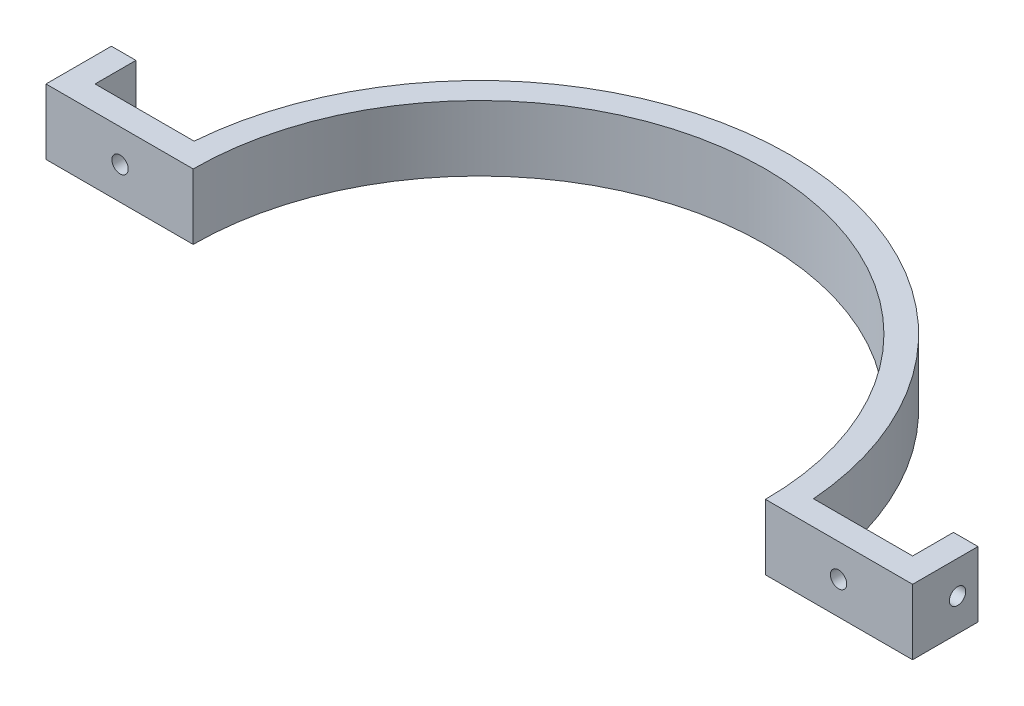
ISO-10303-21;
HEADER;
FILE_DESCRIPTION(('STEP AP214'),'2;1');
FILE_NAME('part.step','',(''),(''),'','','');
FILE_SCHEMA(('AUTOMOTIVE_DESIGN { 1 0 10303 214 1 1 1 1 }'));
ENDSEC;
DATA;
#1=APPLICATION_CONTEXT('core data for automotive mechanical design processes');
#2=APPLICATION_PROTOCOL_DEFINITION('international standard','automotive_design',2000,#1);
#3=PRODUCT_CONTEXT('',#1,'mechanical');
#4=PRODUCT('Part','Part','',(#3));
#5=PRODUCT_RELATED_PRODUCT_CATEGORY('part','',(#4));
#6=PRODUCT_DEFINITION_FORMATION('','',#4);
#7=PRODUCT_DEFINITION_CONTEXT('part definition',#1,'design');
#8=PRODUCT_DEFINITION('design','',#6,#7);
#9=PRODUCT_DEFINITION_SHAPE('','',#8);
#10=(LENGTH_UNIT() NAMED_UNIT(*) SI_UNIT(.MILLI.,.METRE.));
#11=(NAMED_UNIT(*) PLANE_ANGLE_UNIT() SI_UNIT($,.RADIAN.));
#12=(NAMED_UNIT(*) SI_UNIT($,.STERADIAN.) SOLID_ANGLE_UNIT());
#13=UNCERTAINTY_MEASURE_WITH_UNIT(LENGTH_MEASURE(1.E-05),#10,'distance_accuracy_value','');
#14=(GEOMETRIC_REPRESENTATION_CONTEXT(3) GLOBAL_UNCERTAINTY_ASSIGNED_CONTEXT((#13)) GLOBAL_UNIT_ASSIGNED_CONTEXT((#10,
#11,#12)) REPRESENTATION_CONTEXT('',''));
#15=CARTESIAN_POINT('',(0.,0.,0.));
#16=DIRECTION('',(0.,0.,1.));
#17=DIRECTION('',(1.,0.,0.));
#18=AXIS2_PLACEMENT_3D('',#15,#16,#17);
#19=CARTESIAN_POINT('',(0.,12.7,0.));
#20=DIRECTION('',(0.,-1.,0.));
#21=DIRECTION('',(0.,0.,-1.));
#22=AXIS2_PLACEMENT_3D('',#19,#20,#21);
#23=CYLINDRICAL_SURFACE('',#22,55.5625);
#24=CARTESIAN_POINT('',(0.,0.,0.));
#25=DIRECTION('',(0.,-1.,0.));
#26=DIRECTION('',(0.,0.,-1.));
#27=AXIS2_PLACEMENT_3D('',#24,#25,#26);
#28=CIRCLE('',#27,55.5625);
#29=CARTESIAN_POINT('',(-55.5625,0.,0.));
#30=VERTEX_POINT('',#29);
#31=CARTESIAN_POINT('',(55.5625,0.,0.));
#32=VERTEX_POINT('',#31);
#33=EDGE_CURVE('E153',#30,#32,#28,.T.);
#34=ORIENTED_EDGE('',*,*,#33,.T.);
#35=DIRECTION('',(0.,-1.,0.));
#36=VECTOR('',#35,1.);
#37=CARTESIAN_POINT('',(55.5625,12.7,0.));
#38=LINE('',#37,#36);
#39=CARTESIAN_POINT('',(55.5625,12.7,0.));
#40=VERTEX_POINT('',#39);
#41=EDGE_CURVE('E11',#40,#32,#38,.T.);
#42=ORIENTED_EDGE('',*,*,#41,.F.);
#43=CARTESIAN_POINT('',(0.,12.7,0.));
#44=DIRECTION('',(0.,-1.,0.));
#45=DIRECTION('',(0.,0.,-1.));
#46=AXIS2_PLACEMENT_3D('',#43,#44,#45);
#47=CIRCLE('',#46,55.5625);
#48=CARTESIAN_POINT('',(-55.5625,12.7,0.));
#49=VERTEX_POINT('',#48);
#50=EDGE_CURVE('E176',#49,#40,#47,.T.);
#51=ORIENTED_EDGE('',*,*,#50,.F.);
#52=DIRECTION('',(0.,-1.,0.));
#53=VECTOR('',#52,1.);
#54=CARTESIAN_POINT('',(-55.5625,12.7,0.));
#55=LINE('',#54,#53);
#56=EDGE_CURVE('E149',#49,#30,#55,.T.);
#57=ORIENTED_EDGE('',*,*,#56,.T.);
#58=EDGE_LOOP('',(#34,#42,#51,#57));
#59=FACE_BOUND('',#58,.T.);
#60=ADVANCED_FACE('F33',(#59),#23,.F.);
#61=CARTESIAN_POINT('',(55.5625,12.7,0.));
#62=DIRECTION('',(0.,0.,-1.));
#63=DIRECTION('',(-1.,0.,0.));
#64=AXIS2_PLACEMENT_3D('',#61,#62,#63);
#65=PLANE('',#64);
#66=CARTESIAN_POINT('',(69.7558563682403,6.35,0.));
#67=DIRECTION('',(0.,0.,1.));
#68=DIRECTION('',(1.,0.,0.));
#69=AXIS2_PLACEMENT_3D('',#66,#67,#68);
#70=CIRCLE('',#69,1.5875);
#71=CARTESIAN_POINT('',(71.3433563682404,6.35,0.));
#72=VERTEX_POINT('',#71);
#73=EDGE_CURVE('E425',#72,#72,#70,.T.);
#74=ORIENTED_EDGE('',*,*,#73,.F.);
#75=EDGE_LOOP('',(#74));
#76=FACE_BOUND('',#75,.T.);
#77=DIRECTION('',(1.,0.,0.));
#78=VECTOR('',#77,1.);
#79=CARTESIAN_POINT('',(55.5625,0.,0.));
#80=LINE('',#79,#78);
#81=CARTESIAN_POINT('',(84.1375,0.,0.));
#82=VERTEX_POINT('',#81);
#83=EDGE_CURVE('E156',#32,#82,#80,.T.);
#84=ORIENTED_EDGE('',*,*,#83,.T.);
#85=DIRECTION('',(0.,-1.,0.));
#86=VECTOR('',#85,1.);
#87=CARTESIAN_POINT('',(84.1375,12.7,0.));
#88=LINE('',#87,#86);
#89=CARTESIAN_POINT('',(84.1375,12.7,0.));
#90=VERTEX_POINT('',#89);
#91=EDGE_CURVE('E41',#90,#82,#88,.T.);
#92=ORIENTED_EDGE('',*,*,#91,.F.);
#93=DIRECTION('',(1.,0.,0.));
#94=VECTOR('',#93,1.);
#95=CARTESIAN_POINT('',(55.5625,12.7,0.));
#96=LINE('',#95,#94);
#97=EDGE_CURVE('E104',#40,#90,#96,.T.);
#98=ORIENTED_EDGE('',*,*,#97,.F.);
#99=ORIENTED_EDGE('',*,*,#41,.T.);
#100=EDGE_LOOP('',(#84,#92,#98,#99));
#101=FACE_BOUND('',#100,.T.);
#102=ADVANCED_FACE('F257',(#76,#101),#65,.F.);
#103=CARTESIAN_POINT('',(84.1375,12.7,0.));
#104=DIRECTION('',(-1.,0.,0.));
#105=DIRECTION('',(0.,0.,1.));
#106=AXIS2_PLACEMENT_3D('',#103,#104,#105);
#107=PLANE('',#106);
#108=CARTESIAN_POINT('',(84.1375000000001,6.35,-8.73124999999992));
#109=DIRECTION('',(1.,0.,0.));
#110=DIRECTION('',(0.,0.,-1.));
#111=AXIS2_PLACEMENT_3D('',#108,#109,#110);
#112=CIRCLE('',#111,1.5875);
#113=CARTESIAN_POINT('',(84.1375000000001,6.35,-10.3187499999999));
#114=VERTEX_POINT('',#113);
#115=EDGE_CURVE('E430',#114,#114,#112,.T.);
#116=ORIENTED_EDGE('',*,*,#115,.F.);
#117=EDGE_LOOP('',(#116));
#118=FACE_BOUND('',#117,.T.);
#119=DIRECTION('',(0.,0.,-1.));
#120=VECTOR('',#119,1.);
#121=CARTESIAN_POINT('',(84.1375,0.,0.));
#122=LINE('',#121,#120);
#123=CARTESIAN_POINT('',(84.1375,0.,-12.7));
#124=VERTEX_POINT('',#123);
#125=EDGE_CURVE('E159',#82,#124,#122,.T.);
#126=ORIENTED_EDGE('',*,*,#125,.T.);
#127=DIRECTION('',(0.,-1.,0.));
#128=VECTOR('',#127,1.);
#129=CARTESIAN_POINT('',(84.1375,12.7,-12.7));
#130=LINE('',#129,#128);
#131=CARTESIAN_POINT('',(84.1375,12.7,-12.7));
#132=VERTEX_POINT('',#131);
#133=EDGE_CURVE('E195',#132,#124,#130,.T.);
#134=ORIENTED_EDGE('',*,*,#133,.F.);
#135=DIRECTION('',(0.,0.,-1.));
#136=VECTOR('',#135,1.);
#137=CARTESIAN_POINT('',(84.1375,12.7,0.));
#138=LINE('',#137,#136);
#139=EDGE_CURVE('E203',#90,#132,#138,.T.);
#140=ORIENTED_EDGE('',*,*,#139,.F.);
#141=ORIENTED_EDGE('',*,*,#91,.T.);
#142=EDGE_LOOP('',(#126,#134,#140,#141));
#143=FACE_BOUND('',#142,.T.);
#144=ADVANCED_FACE('F201',(#118,#143),#107,.F.);
#145=CARTESIAN_POINT('',(84.1375,12.7,-12.7));
#146=DIRECTION('',(0.,0.,1.));
#147=DIRECTION('',(1.,0.,0.));
#148=AXIS2_PLACEMENT_3D('',#145,#146,#147);
#149=PLANE('',#148);
#150=DIRECTION('',(-1.,0.,0.));
#151=VECTOR('',#150,1.);
#152=CARTESIAN_POINT('',(84.1375,0.,-12.7));
#153=LINE('',#152,#151);
#154=CARTESIAN_POINT('',(79.375,0.,-12.7));
#155=VERTEX_POINT('',#154);
#156=EDGE_CURVE('E161',#124,#155,#153,.T.);
#157=ORIENTED_EDGE('',*,*,#156,.T.);
#158=DIRECTION('',(0.,-1.,0.));
#159=VECTOR('',#158,1.);
#160=CARTESIAN_POINT('',(79.375,12.7,-12.7));
#161=LINE('',#160,#159);
#162=CARTESIAN_POINT('',(79.375,12.7,-12.7));
#163=VERTEX_POINT('',#162);
#164=EDGE_CURVE('E192',#163,#155,#161,.T.);
#165=ORIENTED_EDGE('',*,*,#164,.F.);
#166=DIRECTION('',(-1.,0.,0.));
#167=VECTOR('',#166,1.);
#168=CARTESIAN_POINT('',(84.1375,12.7,-12.7));
#169=LINE('',#168,#167);
#170=EDGE_CURVE('E221',#132,#163,#169,.T.);
#171=ORIENTED_EDGE('',*,*,#170,.F.);
#172=ORIENTED_EDGE('',*,*,#133,.T.);
#173=EDGE_LOOP('',(#157,#165,#171,#172));
#174=FACE_BOUND('',#173,.T.);
#175=ADVANCED_FACE('F212',(#174),#149,.F.);
#176=CARTESIAN_POINT('',(79.375,12.7,-12.7));
#177=DIRECTION('',(1.,0.,0.));
#178=DIRECTION('',(0.,0.,-1.));
#179=AXIS2_PLACEMENT_3D('',#176,#177,#178);
#180=PLANE('',#179);
#181=CARTESIAN_POINT('',(79.375,6.35,-8.73124999999991));
#182=DIRECTION('',(1.,0.,0.));
#183=DIRECTION('',(0.,0.,-1.));
#184=AXIS2_PLACEMENT_3D('',#181,#182,#183);
#185=CIRCLE('',#184,1.5875);
#186=CARTESIAN_POINT('',(79.375,6.35,-10.3187499999999));
#187=VERTEX_POINT('',#186);
#188=EDGE_CURVE('E433',#187,#187,#185,.T.);
#189=ORIENTED_EDGE('',*,*,#188,.T.);
#190=EDGE_LOOP('',(#189));
#191=FACE_BOUND('',#190,.T.);
#192=DIRECTION('',(0.,0.,1.));
#193=VECTOR('',#192,1.);
#194=CARTESIAN_POINT('',(79.375,0.,-12.7));
#195=LINE('',#194,#193);
#196=CARTESIAN_POINT('',(79.375,0.,-4.7625));
#197=VERTEX_POINT('',#196);
#198=EDGE_CURVE('E163',#155,#197,#195,.T.);
#199=ORIENTED_EDGE('',*,*,#198,.T.);
#200=DIRECTION('',(0.,-1.,0.));
#201=VECTOR('',#200,1.);
#202=CARTESIAN_POINT('',(79.375,12.7,-4.7625));
#203=LINE('',#202,#201);
#204=CARTESIAN_POINT('',(79.375,12.7,-4.7625));
#205=VERTEX_POINT('',#204);
#206=EDGE_CURVE('E189',#205,#197,#203,.T.);
#207=ORIENTED_EDGE('',*,*,#206,.F.);
#208=DIRECTION('',(0.,0.,1.));
#209=VECTOR('',#208,1.);
#210=CARTESIAN_POINT('',(79.375,12.7,-12.7));
#211=LINE('',#210,#209);
#212=EDGE_CURVE('E218',#163,#205,#211,.T.);
#213=ORIENTED_EDGE('',*,*,#212,.F.);
#214=ORIENTED_EDGE('',*,*,#164,.T.);
#215=EDGE_LOOP('',(#199,#207,#213,#214));
#216=FACE_BOUND('',#215,.T.);
#217=ADVANCED_FACE('F216',(#191,#216),#180,.F.);
#218=CARTESIAN_POINT('',(79.375,12.7,-4.7625));
#219=DIRECTION('',(0.,0.,1.));
#220=DIRECTION('',(1.,0.,0.));
#221=AXIS2_PLACEMENT_3D('',#218,#219,#220);
#222=PLANE('',#221);
#223=CARTESIAN_POINT('',(69.7558563682403,6.35,-4.7625));
#224=DIRECTION('',(0.,0.,1.));
#225=DIRECTION('',(1.,0.,0.));
#226=AXIS2_PLACEMENT_3D('',#223,#224,#225);
#227=CIRCLE('',#226,1.5875);
#228=CARTESIAN_POINT('',(71.3433563682404,6.35,-4.7625));
#229=VERTEX_POINT('',#228);
#230=EDGE_CURVE('E427',#229,#229,#227,.T.);
#231=ORIENTED_EDGE('',*,*,#230,.T.);
#232=EDGE_LOOP('',(#231));
#233=FACE_BOUND('',#232,.T.);
#234=DIRECTION('',(-1.,0.,0.));
#235=VECTOR('',#234,1.);
#236=CARTESIAN_POINT('',(79.375,0.,-4.7625));
#237=LINE('',#236,#235);
#238=CARTESIAN_POINT('',(60.1367127364807,0.,-4.76250000000003));
#239=VERTEX_POINT('',#238);
#240=EDGE_CURVE('E165',#197,#239,#237,.T.);
#241=ORIENTED_EDGE('',*,*,#240,.T.);
#242=DIRECTION('',(0.,-1.,0.));
#243=VECTOR('',#242,1.);
#244=CARTESIAN_POINT('',(60.1367127364807,12.7,-4.76250000000003));
#245=LINE('',#244,#243);
#246=CARTESIAN_POINT('',(60.1367127364807,12.7,-4.76250000000003));
#247=VERTEX_POINT('',#246);
#248=EDGE_CURVE('E186',#247,#239,#245,.T.);
#249=ORIENTED_EDGE('',*,*,#248,.F.);
#250=DIRECTION('',(-1.,0.,0.));
#251=VECTOR('',#250,1.);
#252=CARTESIAN_POINT('',(79.375,12.7,-4.7625));
#253=LINE('',#252,#251);
#254=EDGE_CURVE('E220',#205,#247,#253,.T.);
#255=ORIENTED_EDGE('',*,*,#254,.F.);
#256=ORIENTED_EDGE('',*,*,#206,.T.);
#257=EDGE_LOOP('',(#241,#249,#255,#256));
#258=FACE_BOUND('',#257,.T.);
#259=ADVANCED_FACE('F273',(#233,#258),#222,.F.);
#260=CARTESIAN_POINT('',(0.,12.7,0.));
#261=DIRECTION('',(0.,-1.,0.));
#262=DIRECTION('',(0.,0.,-1.));
#263=AXIS2_PLACEMENT_3D('',#260,#261,#262);
#264=CYLINDRICAL_SURFACE('',#263,60.325);
#265=CARTESIAN_POINT('',(0.,0.,0.));
#266=DIRECTION('',(0.,1.,0.));
#267=DIRECTION('',(0.,0.,-1.));
#268=AXIS2_PLACEMENT_3D('',#265,#266,#267);
#269=CIRCLE('',#268,60.325);
#270=CARTESIAN_POINT('',(-60.1367127364807,0.,-4.7625));
#271=VERTEX_POINT('',#270);
#272=EDGE_CURVE('E167',#239,#271,#269,.T.);
#273=ORIENTED_EDGE('',*,*,#272,.T.);
#274=DIRECTION('',(0.,-1.,0.));
#275=VECTOR('',#274,1.);
#276=CARTESIAN_POINT('',(-60.1367127364807,12.7,-4.7625));
#277=LINE('',#276,#275);
#278=CARTESIAN_POINT('',(-60.1367127364807,12.7,-4.7625));
#279=VERTEX_POINT('',#278);
#280=EDGE_CURVE('E183',#279,#271,#277,.T.);
#281=ORIENTED_EDGE('',*,*,#280,.F.);
#282=CARTESIAN_POINT('',(0.,12.7,0.));
#283=DIRECTION('',(0.,1.,0.));
#284=DIRECTION('',(0.,0.,-1.));
#285=AXIS2_PLACEMENT_3D('',#282,#283,#284);
#286=CIRCLE('',#285,60.325);
#287=EDGE_CURVE('E223',#247,#279,#286,.T.);
#288=ORIENTED_EDGE('',*,*,#287,.F.);
#289=ORIENTED_EDGE('',*,*,#248,.T.);
#290=EDGE_LOOP('',(#273,#281,#288,#289));
#291=FACE_BOUND('',#290,.T.);
#292=ADVANCED_FACE('F277',(#291),#264,.T.);
#293=CARTESIAN_POINT('',(-79.375,12.7,-4.7625));
#294=DIRECTION('',(0.,0.,1.));
#295=DIRECTION('',(1.,0.,0.));
#296=AXIS2_PLACEMENT_3D('',#293,#294,#295);
#297=PLANE('',#296);
#298=CARTESIAN_POINT('',(-69.7558563682403,6.35,-4.7625));
#299=DIRECTION('',(0.,0.,-1.));
#300=DIRECTION('',(-1.,0.,0.));
#301=AXIS2_PLACEMENT_3D('',#298,#299,#300);
#302=CIRCLE('',#301,1.5875);
#303=CARTESIAN_POINT('',(-71.3433563682404,6.35,-4.7625));
#304=VERTEX_POINT('',#303);
#305=EDGE_CURVE('E414',#304,#304,#302,.T.);
#306=ORIENTED_EDGE('',*,*,#305,.F.);
#307=EDGE_LOOP('',(#306));
#308=FACE_BOUND('',#307,.T.);
#309=DIRECTION('',(-1.,0.,0.));
#310=VECTOR('',#309,1.);
#311=CARTESIAN_POINT('',(-79.375,0.,-4.7625));
#312=LINE('',#311,#310);
#313=CARTESIAN_POINT('',(-79.375,0.,-4.7625));
#314=VERTEX_POINT('',#313);
#315=EDGE_CURVE('E169',#271,#314,#312,.T.);
#316=ORIENTED_EDGE('',*,*,#315,.T.);
#317=DIRECTION('',(0.,-1.,0.));
#318=VECTOR('',#317,1.);
#319=CARTESIAN_POINT('',(-79.375,12.7,-4.7625));
#320=LINE('',#319,#318);
#321=CARTESIAN_POINT('',(-79.375,12.7,-4.7625));
#322=VERTEX_POINT('',#321);
#323=EDGE_CURVE('E180',#322,#314,#320,.T.);
#324=ORIENTED_EDGE('',*,*,#323,.F.);
#325=DIRECTION('',(-1.,0.,0.));
#326=VECTOR('',#325,1.);
#327=CARTESIAN_POINT('',(-79.375,12.7,-4.7625));
#328=LINE('',#327,#326);
#329=EDGE_CURVE('E229',#279,#322,#328,.T.);
#330=ORIENTED_EDGE('',*,*,#329,.F.);
#331=ORIENTED_EDGE('',*,*,#280,.T.);
#332=EDGE_LOOP('',(#316,#324,#330,#331));
#333=FACE_BOUND('',#332,.T.);
#334=ADVANCED_FACE('F235',(#308,#333),#297,.F.);
#335=CARTESIAN_POINT('',(-79.375,12.7,-12.7));
#336=DIRECTION('',(-1.,0.,0.));
#337=DIRECTION('',(0.,0.,1.));
#338=AXIS2_PLACEMENT_3D('',#335,#336,#337);
#339=PLANE('',#338);
#340=CARTESIAN_POINT('',(-79.375,6.35,-8.73124999999991));
#341=DIRECTION('',(1.,0.,0.));
#342=DIRECTION('',(0.,0.,-1.));
#343=AXIS2_PLACEMENT_3D('',#340,#341,#342);
#344=CIRCLE('',#343,1.5875);
#345=CARTESIAN_POINT('',(-79.375,6.35,-10.3187499999999));
#346=VERTEX_POINT('',#345);
#347=EDGE_CURVE('E419',#346,#346,#344,.T.);
#348=ORIENTED_EDGE('',*,*,#347,.F.);
#349=EDGE_LOOP('',(#348));
#350=FACE_BOUND('',#349,.T.);
#351=DIRECTION('',(0.,0.,-1.));
#352=VECTOR('',#351,1.);
#353=CARTESIAN_POINT('',(-79.375,0.,-12.7));
#354=LINE('',#353,#352);
#355=CARTESIAN_POINT('',(-79.375,0.,-12.7));
#356=VERTEX_POINT('',#355);
#357=EDGE_CURVE('E171',#314,#356,#354,.T.);
#358=ORIENTED_EDGE('',*,*,#357,.T.);
#359=DIRECTION('',(0.,-1.,0.));
#360=VECTOR('',#359,1.);
#361=CARTESIAN_POINT('',(-79.375,12.7,-12.7));
#362=LINE('',#361,#360);
#363=CARTESIAN_POINT('',(-79.375,12.7,-12.7));
#364=VERTEX_POINT('',#363);
#365=EDGE_CURVE('E144',#364,#356,#362,.T.);
#366=ORIENTED_EDGE('',*,*,#365,.F.);
#367=DIRECTION('',(0.,0.,-1.));
#368=VECTOR('',#367,1.);
#369=CARTESIAN_POINT('',(-79.375,12.7,-12.7));
#370=LINE('',#369,#368);
#371=EDGE_CURVE('E135',#322,#364,#370,.T.);
#372=ORIENTED_EDGE('',*,*,#371,.F.);
#373=ORIENTED_EDGE('',*,*,#323,.T.);
#374=EDGE_LOOP('',(#358,#366,#372,#373));
#375=FACE_BOUND('',#374,.T.);
#376=ADVANCED_FACE('F239',(#350,#375),#339,.F.);
#377=CARTESIAN_POINT('',(-84.1375,12.7,-12.7));
#378=DIRECTION('',(0.,0.,1.));
#379=DIRECTION('',(1.,0.,0.));
#380=AXIS2_PLACEMENT_3D('',#377,#378,#379);
#381=PLANE('',#380);
#382=DIRECTION('',(-1.,0.,0.));
#383=VECTOR('',#382,1.);
#384=CARTESIAN_POINT('',(-84.1375,0.,-12.7));
#385=LINE('',#384,#383);
#386=CARTESIAN_POINT('',(-84.1375,0.,-12.7));
#387=VERTEX_POINT('',#386);
#388=EDGE_CURVE('E143',#356,#387,#385,.T.);
#389=ORIENTED_EDGE('',*,*,#388,.T.);
#390=DIRECTION('',(0.,-1.,0.));
#391=VECTOR('',#390,1.);
#392=CARTESIAN_POINT('',(-84.1375,12.7,-12.7));
#393=LINE('',#392,#391);
#394=CARTESIAN_POINT('',(-84.1375,12.7,-12.7));
#395=VERTEX_POINT('',#394);
#396=EDGE_CURVE('E140',#395,#387,#393,.T.);
#397=ORIENTED_EDGE('',*,*,#396,.F.);
#398=DIRECTION('',(-1.,0.,0.));
#399=VECTOR('',#398,1.);
#400=CARTESIAN_POINT('',(-84.1375,12.7,-12.7));
#401=LINE('',#400,#399);
#402=EDGE_CURVE('E129',#364,#395,#401,.T.);
#403=ORIENTED_EDGE('',*,*,#402,.F.);
#404=ORIENTED_EDGE('',*,*,#365,.T.);
#405=EDGE_LOOP('',(#389,#397,#403,#404));
#406=FACE_BOUND('',#405,.T.);
#407=ADVANCED_FACE('F141',(#406),#381,.F.);
#408=CARTESIAN_POINT('',(-84.1375,12.7,0.));
#409=DIRECTION('',(1.,0.,0.));
#410=DIRECTION('',(0.,0.,-1.));
#411=AXIS2_PLACEMENT_3D('',#408,#409,#410);
#412=PLANE('',#411);
#413=CARTESIAN_POINT('',(-84.1375000000001,6.35,-8.73124999999992));
#414=DIRECTION('',(1.,0.,0.));
#415=DIRECTION('',(0.,0.,-1.));
#416=AXIS2_PLACEMENT_3D('',#413,#414,#415);
#417=CIRCLE('',#416,1.5875);
#418=CARTESIAN_POINT('',(-84.1375000000001,6.35,-10.3187499999999));
#419=VERTEX_POINT('',#418);
#420=EDGE_CURVE('E415',#419,#419,#417,.T.);
#421=ORIENTED_EDGE('',*,*,#420,.T.);
#422=EDGE_LOOP('',(#421));
#423=FACE_BOUND('',#422,.T.);
#424=DIRECTION('',(0.,0.,1.));
#425=VECTOR('',#424,1.);
#426=CARTESIAN_POINT('',(-84.1375,0.,0.));
#427=LINE('',#426,#425);
#428=CARTESIAN_POINT('',(-84.1375,0.,0.));
#429=VERTEX_POINT('',#428);
#430=EDGE_CURVE('E90',#387,#429,#427,.T.);
#431=ORIENTED_EDGE('',*,*,#430,.T.);
#432=DIRECTION('',(0.,-1.,0.));
#433=VECTOR('',#432,1.);
#434=CARTESIAN_POINT('',(-84.1375,12.7,0.));
#435=LINE('',#434,#433);
#436=CARTESIAN_POINT('',(-84.1375,12.7,0.));
#437=VERTEX_POINT('',#436);
#438=EDGE_CURVE('E145',#437,#429,#435,.T.);
#439=ORIENTED_EDGE('',*,*,#438,.F.);
#440=DIRECTION('',(0.,0.,1.));
#441=VECTOR('',#440,1.);
#442=CARTESIAN_POINT('',(-84.1375,12.7,0.));
#443=LINE('',#442,#441);
#444=EDGE_CURVE('E133',#395,#437,#443,.T.);
#445=ORIENTED_EDGE('',*,*,#444,.F.);
#446=ORIENTED_EDGE('',*,*,#396,.T.);
#447=EDGE_LOOP('',(#431,#439,#445,#446));
#448=FACE_BOUND('',#447,.T.);
#449=ADVANCED_FACE('F147',(#423,#448),#412,.F.);
#450=CARTESIAN_POINT('',(-55.5625,12.7,0.));
#451=DIRECTION('',(0.,0.,-1.));
#452=DIRECTION('',(-1.,0.,0.));
#453=AXIS2_PLACEMENT_3D('',#450,#451,#452);
#454=PLANE('',#453);
#455=CARTESIAN_POINT('',(-69.7558563682403,6.35,0.));
#456=DIRECTION('',(0.,0.,-1.));
#457=DIRECTION('',(-1.,0.,0.));
#458=AXIS2_PLACEMENT_3D('',#455,#456,#457);
#459=CIRCLE('',#458,1.5875);
#460=CARTESIAN_POINT('',(-71.3433563682404,6.35,0.));
#461=VERTEX_POINT('',#460);
#462=EDGE_CURVE('E157',#461,#461,#459,.T.);
#463=ORIENTED_EDGE('',*,*,#462,.T.);
#464=EDGE_LOOP('',(#463));
#465=FACE_BOUND('',#464,.T.);
#466=DIRECTION('',(1.,0.,0.));
#467=VECTOR('',#466,1.);
#468=CARTESIAN_POINT('',(-55.5625,0.,0.));
#469=LINE('',#468,#467);
#470=EDGE_CURVE('E96',#429,#30,#469,.T.);
#471=ORIENTED_EDGE('',*,*,#470,.T.);
#472=ORIENTED_EDGE('',*,*,#56,.F.);
#473=DIRECTION('',(1.,0.,0.));
#474=VECTOR('',#473,1.);
#475=CARTESIAN_POINT('',(-55.5625,12.7,0.));
#476=LINE('',#475,#474);
#477=EDGE_CURVE('E49',#437,#49,#476,.T.);
#478=ORIENTED_EDGE('',*,*,#477,.F.);
#479=ORIENTED_EDGE('',*,*,#438,.T.);
#480=EDGE_LOOP('',(#471,#472,#478,#479));
#481=FACE_BOUND('',#480,.T.);
#482=ADVANCED_FACE('F243',(#465,#481),#454,.F.);
#483=CARTESIAN_POINT('',(0.,12.7,0.));
#484=DIRECTION('',(0.,-1.,0.));
#485=DIRECTION('',(0.,0.,-1.));
#486=AXIS2_PLACEMENT_3D('',#483,#484,#485);
#487=PLANE('',#486);
#488=ORIENTED_EDGE('',*,*,#50,.T.);
#489=ORIENTED_EDGE('',*,*,#97,.T.);
#490=ORIENTED_EDGE('',*,*,#139,.T.);
#491=ORIENTED_EDGE('',*,*,#170,.T.);
#492=ORIENTED_EDGE('',*,*,#212,.T.);
#493=ORIENTED_EDGE('',*,*,#254,.T.);
#494=ORIENTED_EDGE('',*,*,#287,.T.);
#495=ORIENTED_EDGE('',*,*,#329,.T.);
#496=ORIENTED_EDGE('',*,*,#371,.T.);
#497=ORIENTED_EDGE('',*,*,#402,.T.);
#498=ORIENTED_EDGE('',*,*,#444,.T.);
#499=ORIENTED_EDGE('',*,*,#477,.T.);
#500=EDGE_LOOP('',(#488,#489,#490,#491,#492,#493,#494,#495,#496,#497,#498,#499));
#501=FACE_BOUND('',#500,.T.);
#502=ADVANCED_FACE('F131',(#501),#487,.F.);
#503=CARTESIAN_POINT('',(0.,0.,0.));
#504=DIRECTION('',(0.,-1.,0.));
#505=DIRECTION('',(0.,0.,-1.));
#506=AXIS2_PLACEMENT_3D('',#503,#504,#505);
#507=PLANE('',#506);
#508=ORIENTED_EDGE('',*,*,#33,.F.);
#509=ORIENTED_EDGE('',*,*,#470,.F.);
#510=ORIENTED_EDGE('',*,*,#430,.F.);
#511=ORIENTED_EDGE('',*,*,#388,.F.);
#512=ORIENTED_EDGE('',*,*,#357,.F.);
#513=ORIENTED_EDGE('',*,*,#315,.F.);
#514=ORIENTED_EDGE('',*,*,#272,.F.);
#515=ORIENTED_EDGE('',*,*,#240,.F.);
#516=ORIENTED_EDGE('',*,*,#198,.F.);
#517=ORIENTED_EDGE('',*,*,#156,.F.);
#518=ORIENTED_EDGE('',*,*,#125,.F.);
#519=ORIENTED_EDGE('',*,*,#83,.F.);
#520=EDGE_LOOP('',(#508,#509,#510,#511,#512,#513,#514,#515,#516,#517,#518,#519));
#521=FACE_BOUND('',#520,.T.);
#522=ADVANCED_FACE('F207',(#521),#507,.T.);
#523=CARTESIAN_POINT('',(-69.7558563682403,6.35,0.));
#524=DIRECTION('',(0.,0.,-1.));
#525=DIRECTION('',(-1.,0.,0.));
#526=AXIS2_PLACEMENT_3D('',#523,#524,#525);
#527=CYLINDRICAL_SURFACE('',#526,1.5875);
#528=ORIENTED_EDGE('',*,*,#462,.F.);
#529=EDGE_LOOP('',(#528));
#530=FACE_BOUND('',#529,.T.);
#531=ORIENTED_EDGE('',*,*,#305,.T.);
#532=EDGE_LOOP('',(#531));
#533=FACE_BOUND('',#532,.T.);
#534=ADVANCED_FACE('F313',(#530,#533),#527,.F.);
#535=CARTESIAN_POINT('',(-84.1375000000001,6.35,-8.73124999999992));
#536=DIRECTION('',(1.,0.,0.));
#537=DIRECTION('',(0.,0.,-1.));
#538=AXIS2_PLACEMENT_3D('',#535,#536,#537);
#539=CYLINDRICAL_SURFACE('',#538,1.5875);
#540=ORIENTED_EDGE('',*,*,#420,.F.);
#541=EDGE_LOOP('',(#540));
#542=FACE_BOUND('',#541,.T.);
#543=ORIENTED_EDGE('',*,*,#347,.T.);
#544=EDGE_LOOP('',(#543));
#545=FACE_BOUND('',#544,.T.);
#546=ADVANCED_FACE('F308',(#542,#545),#539,.F.);
#547=CARTESIAN_POINT('',(69.7558563682403,6.35,0.));
#548=DIRECTION('',(0.,0.,-1.));
#549=DIRECTION('',(-1.,0.,0.));
#550=AXIS2_PLACEMENT_3D('',#547,#548,#549);
#551=CYLINDRICAL_SURFACE('',#550,1.5875);
#552=ORIENTED_EDGE('',*,*,#73,.T.);
#553=EDGE_LOOP('',(#552));
#554=FACE_BOUND('',#553,.T.);
#555=ORIENTED_EDGE('',*,*,#230,.F.);
#556=EDGE_LOOP('',(#555));
#557=FACE_BOUND('',#556,.T.);
#558=ADVANCED_FACE('F312',(#554,#557),#551,.F.);
#559=CARTESIAN_POINT('',(84.1375000000001,6.35,-8.73124999999992));
#560=DIRECTION('',(-1.,0.,0.));
#561=DIRECTION('',(0.,0.,1.));
#562=AXIS2_PLACEMENT_3D('',#559,#560,#561);
#563=CYLINDRICAL_SURFACE('',#562,1.5875);
#564=ORIENTED_EDGE('',*,*,#115,.T.);
#565=EDGE_LOOP('',(#564));
#566=FACE_BOUND('',#565,.T.);
#567=ORIENTED_EDGE('',*,*,#188,.F.);
#568=EDGE_LOOP('',(#567));
#569=FACE_BOUND('',#568,.T.);
#570=ADVANCED_FACE('F351',(#566,#569),#563,.F.);
#571=CLOSED_SHELL('',(#60,#102,#144,#175,#217,#259,#292,#334,#376,#407,#449,#482,#502,#522,#534,
#546,#558,#570));
#572=MANIFOLD_SOLID_BREP('B2',#571);
#573=ADVANCED_BREP_SHAPE_REPRESENTATION('',(#18,#572),#14);
#574=SHAPE_DEFINITION_REPRESENTATION(#9,#573);
ENDSEC;
END-ISO-10303-21;
